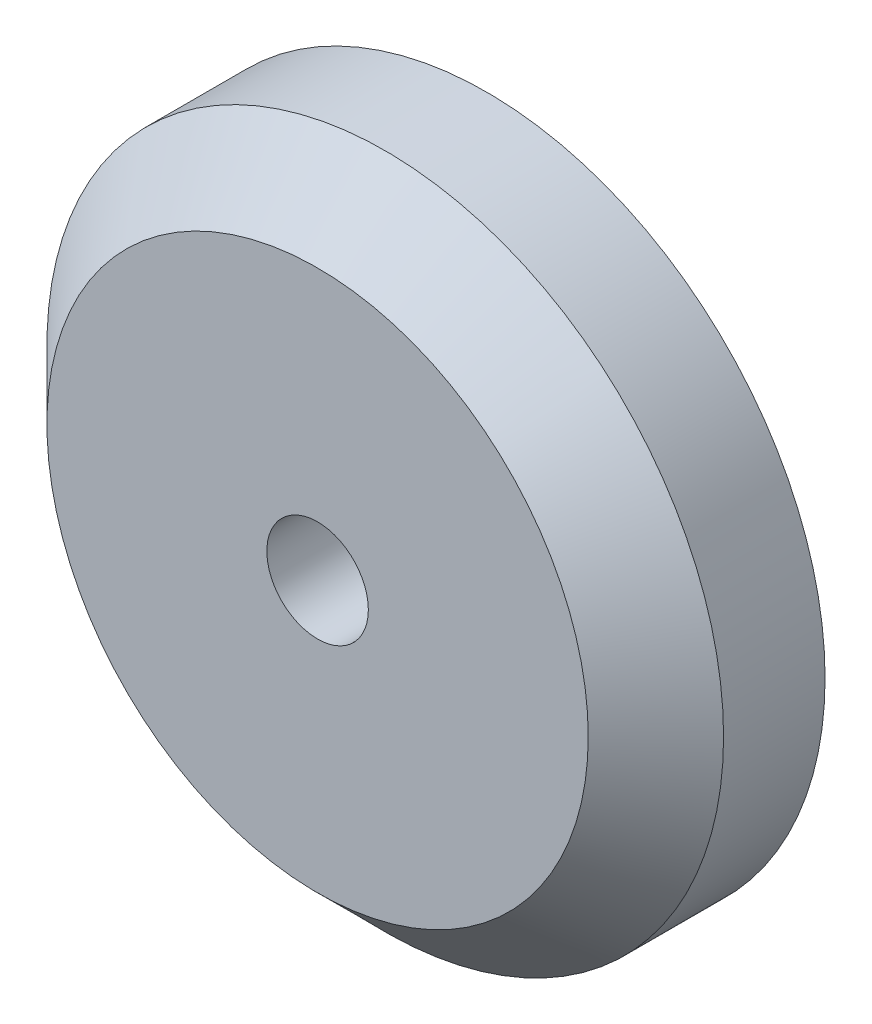
ISO-10303-21;
HEADER;
FILE_DESCRIPTION(('STEP AP214'),'2;1');
FILE_NAME('part.step','',(''),(''),'','','');
FILE_SCHEMA(('AUTOMOTIVE_DESIGN { 1 0 10303 214 1 1 1 1 }'));
ENDSEC;
DATA;
#1=APPLICATION_CONTEXT('core data for automotive mechanical design processes');
#2=APPLICATION_PROTOCOL_DEFINITION('international standard','automotive_design',2000,#1);
#3=PRODUCT_CONTEXT('',#1,'mechanical');
#4=PRODUCT('Part','Part','',(#3));
#5=PRODUCT_RELATED_PRODUCT_CATEGORY('part','',(#4));
#6=PRODUCT_DEFINITION_FORMATION('','',#4);
#7=PRODUCT_DEFINITION_CONTEXT('part definition',#1,'design');
#8=PRODUCT_DEFINITION('design','',#6,#7);
#9=PRODUCT_DEFINITION_SHAPE('','',#8);
#10=(LENGTH_UNIT() NAMED_UNIT(*) SI_UNIT(.MILLI.,.METRE.));
#11=(NAMED_UNIT(*) PLANE_ANGLE_UNIT() SI_UNIT($,.RADIAN.));
#12=(NAMED_UNIT(*) SI_UNIT($,.STERADIAN.) SOLID_ANGLE_UNIT());
#13=UNCERTAINTY_MEASURE_WITH_UNIT(LENGTH_MEASURE(1.E-05),#10,'distance_accuracy_value','');
#14=(GEOMETRIC_REPRESENTATION_CONTEXT(3) GLOBAL_UNCERTAINTY_ASSIGNED_CONTEXT((#13)) GLOBAL_UNIT_ASSIGNED_CONTEXT((#10,
#11,#12)) REPRESENTATION_CONTEXT('',''));
#15=CARTESIAN_POINT('',(0.,0.,0.));
#16=DIRECTION('',(0.,0.,1.));
#17=DIRECTION('',(1.,0.,0.));
#18=AXIS2_PLACEMENT_3D('',#15,#16,#17);
#19=CARTESIAN_POINT('',(0.,0.,5.));
#20=DIRECTION('',(0.,0.,-1.));
#21=DIRECTION('',(-1.,0.,0.));
#22=AXIS2_PLACEMENT_3D('',#19,#20,#21);
#23=CYLINDRICAL_SURFACE('',#22,10.);
#24=CARTESIAN_POINT('',(0.,0.,3.));
#25=DIRECTION('',(0.,0.,1.));
#26=DIRECTION('',(1.,0.,0.));
#27=AXIS2_PLACEMENT_3D('',#24,#25,#26);
#28=CIRCLE('',#27,10.);
#29=CARTESIAN_POINT('',(10.,0.,3.));
#30=VERTEX_POINT('',#29);
#31=EDGE_CURVE('E10',#30,#30,#28,.F.);
#32=ORIENTED_EDGE('',*,*,#31,.T.);
#33=EDGE_LOOP('',(#32));
#34=FACE_BOUND('',#33,.T.);
#35=CARTESIAN_POINT('',(0.,0.,0.));
#36=DIRECTION('',(0.,0.,1.));
#37=DIRECTION('',(1.,0.,0.));
#38=AXIS2_PLACEMENT_3D('',#35,#36,#37);
#39=CIRCLE('',#38,10.);
#40=CARTESIAN_POINT('',(10.,0.,0.));
#41=VERTEX_POINT('',#40);
#42=EDGE_CURVE('E53',#41,#41,#39,.T.);
#43=ORIENTED_EDGE('',*,*,#42,.T.);
#44=EDGE_LOOP('',(#43));
#45=FACE_BOUND('',#44,.T.);
#46=ADVANCED_FACE('F39',(#34,#45),#23,.T.);
#47=CARTESIAN_POINT('',(0.,0.,5.));
#48=DIRECTION('',(0.,0.,1.));
#49=DIRECTION('',(1.,0.,0.));
#50=AXIS2_PLACEMENT_3D('',#47,#48,#49);
#51=PLANE('',#50);
#52=CARTESIAN_POINT('',(0.,0.,5.));
#53=DIRECTION('',(0.,0.,1.));
#54=DIRECTION('',(1.,0.,0.));
#55=AXIS2_PLACEMENT_3D('',#52,#53,#54);
#56=CIRCLE('',#55,1.5);
#57=CARTESIAN_POINT('',(1.5,0.,5.));
#58=VERTEX_POINT('',#57);
#59=EDGE_CURVE('E61',#58,#58,#56,.T.);
#60=ORIENTED_EDGE('',*,*,#59,.F.);
#61=EDGE_LOOP('',(#60));
#62=FACE_BOUND('',#61,.T.);
#63=CARTESIAN_POINT('',(0.,0.,5.));
#64=DIRECTION('',(0.,0.,1.));
#65=DIRECTION('',(1.,0.,0.));
#66=AXIS2_PLACEMENT_3D('',#63,#64,#65);
#67=CIRCLE('',#66,8.);
#68=CARTESIAN_POINT('',(8.,0.,5.));
#69=VERTEX_POINT('',#68);
#70=EDGE_CURVE('E48',#69,#69,#67,.T.);
#71=ORIENTED_EDGE('',*,*,#70,.T.);
#72=EDGE_LOOP('',(#71));
#73=FACE_BOUND('',#72,.T.);
#74=ADVANCED_FACE('F78',(#62,#73),#51,.T.);
#75=CARTESIAN_POINT('',(0.,0.,0.));
#76=DIRECTION('',(0.,0.,1.));
#77=DIRECTION('',(1.,0.,0.));
#78=AXIS2_PLACEMENT_3D('',#75,#76,#77);
#79=PLANE('',#78);
#80=CARTESIAN_POINT('',(0.,0.,0.));
#81=DIRECTION('',(0.,0.,1.));
#82=DIRECTION('',(1.,0.,0.));
#83=AXIS2_PLACEMENT_3D('',#80,#81,#82);
#84=CIRCLE('',#83,1.5);
#85=CARTESIAN_POINT('',(1.5,0.,0.));
#86=VERTEX_POINT('',#85);
#87=EDGE_CURVE('E58',#86,#86,#84,.T.);
#88=ORIENTED_EDGE('',*,*,#87,.T.);
#89=EDGE_LOOP('',(#88));
#90=FACE_BOUND('',#89,.T.);
#91=ORIENTED_EDGE('',*,*,#42,.F.);
#92=EDGE_LOOP('',(#91));
#93=FACE_BOUND('',#92,.T.);
#94=ADVANCED_FACE('F69',(#90,#93),#79,.F.);
#95=CARTESIAN_POINT('',(0.,0.,5.));
#96=DIRECTION('',(0.,0.,-1.));
#97=DIRECTION('',(-1.,0.,0.));
#98=AXIS2_PLACEMENT_3D('',#95,#96,#97);
#99=CONICAL_SURFACE('',#98,8.,0.785398163397447);
#100=ORIENTED_EDGE('',*,*,#31,.F.);
#101=EDGE_LOOP('',(#100));
#102=FACE_BOUND('',#101,.T.);
#103=ORIENTED_EDGE('',*,*,#70,.F.);
#104=EDGE_LOOP('',(#103));
#105=FACE_BOUND('',#104,.T.);
#106=ADVANCED_FACE('F42',(#102,#105),#99,.T.);
#107=CARTESIAN_POINT('',(0.,0.,0.));
#108=DIRECTION('',(0.,0.,1.));
#109=DIRECTION('',(1.,0.,0.));
#110=AXIS2_PLACEMENT_3D('',#107,#108,#109);
#111=CYLINDRICAL_SURFACE('',#110,1.5);
#112=ORIENTED_EDGE('',*,*,#87,.F.);
#113=EDGE_LOOP('',(#112));
#114=FACE_BOUND('',#113,.T.);
#115=ORIENTED_EDGE('',*,*,#59,.T.);
#116=EDGE_LOOP('',(#115));
#117=FACE_BOUND('',#116,.T.);
#118=ADVANCED_FACE('F72',(#114,#117),#111,.F.);
#119=CLOSED_SHELL('',(#46,#74,#94,#106,#118));
#120=MANIFOLD_SOLID_BREP('B2',#119);
#121=ADVANCED_BREP_SHAPE_REPRESENTATION('',(#18,#120),#14);
#122=SHAPE_DEFINITION_REPRESENTATION(#9,#121);
ENDSEC;
END-ISO-10303-21;
